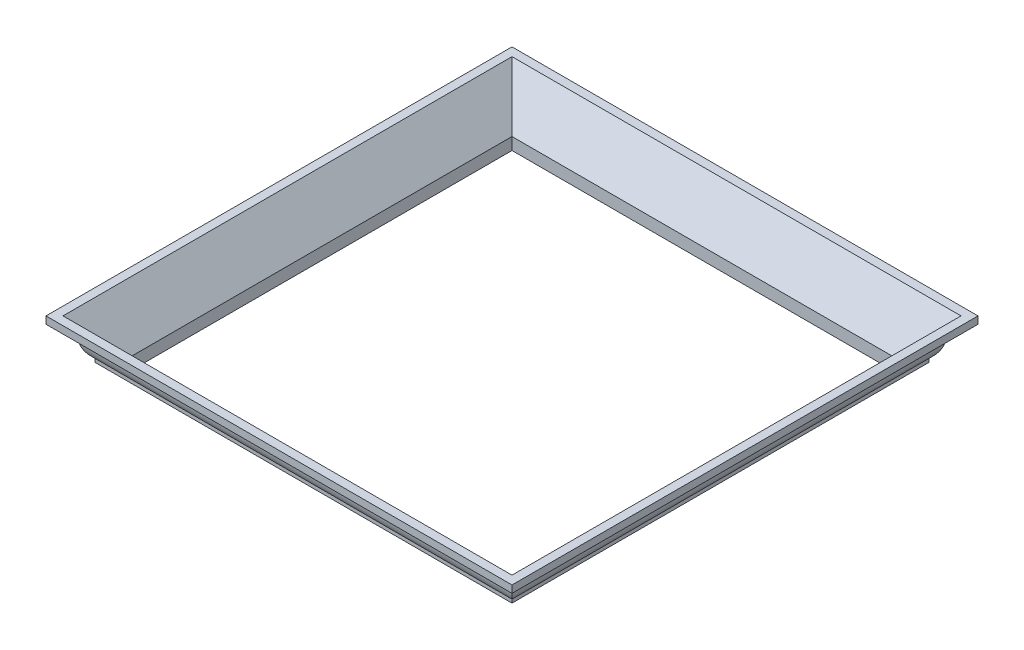
ISO-10303-21;
HEADER;
FILE_DESCRIPTION(('STEP AP214'),'2;1');
FILE_NAME('part.step','',(''),(''),'','','');
FILE_SCHEMA(('AUTOMOTIVE_DESIGN { 1 0 10303 214 1 1 1 1 }'));
ENDSEC;
DATA;
#1=APPLICATION_CONTEXT('core data for automotive mechanical design processes');
#2=APPLICATION_PROTOCOL_DEFINITION('international standard','automotive_design',2000,#1);
#3=PRODUCT_CONTEXT('',#1,'mechanical');
#4=PRODUCT('Part','Part','',(#3));
#5=PRODUCT_RELATED_PRODUCT_CATEGORY('part','',(#4));
#6=PRODUCT_DEFINITION_FORMATION('','',#4);
#7=PRODUCT_DEFINITION_CONTEXT('part definition',#1,'design');
#8=PRODUCT_DEFINITION('design','',#6,#7);
#9=PRODUCT_DEFINITION_SHAPE('','',#8);
#10=(LENGTH_UNIT() NAMED_UNIT(*) SI_UNIT(.MILLI.,.METRE.));
#11=(NAMED_UNIT(*) PLANE_ANGLE_UNIT() SI_UNIT($,.RADIAN.));
#12=(NAMED_UNIT(*) SI_UNIT($,.STERADIAN.) SOLID_ANGLE_UNIT());
#13=UNCERTAINTY_MEASURE_WITH_UNIT(LENGTH_MEASURE(1.E-05),#10,'distance_accuracy_value','');
#14=(GEOMETRIC_REPRESENTATION_CONTEXT(3) GLOBAL_UNCERTAINTY_ASSIGNED_CONTEXT((#13)) GLOBAL_UNIT_ASSIGNED_CONTEXT((#10,
#11,#12)) REPRESENTATION_CONTEXT('',''));
#15=CARTESIAN_POINT('',(0.,0.,0.));
#16=DIRECTION('',(0.,0.,1.));
#17=DIRECTION('',(1.,0.,0.));
#18=AXIS2_PLACEMENT_3D('',#15,#16,#17);
#19=CARTESIAN_POINT('',(0.,0.,1219.2));
#20=DIRECTION('',(0.,1.,0.));
#21=DIRECTION('',(0.,0.,1.));
#22=AXIS2_PLACEMENT_3D('',#19,#20,#21);
#23=PLANE('',#22);
#24=DIRECTION('',(1.,0.,0.));
#25=VECTOR('',#24,1.);
#26=CARTESIAN_POINT('',(-1117.6,0.,92.0750000000012));
#27=LINE('',#26,#25);
#28=CARTESIAN_POINT('',(-1025.525,0.,92.0750000000011));
#29=VERTEX_POINT('',#28);
#30=CARTESIAN_POINT('',(9.52499999999935,0.,92.0750000000002));
#31=VERTEX_POINT('',#30);
#32=EDGE_CURVE('E292',#29,#31,#27,.T.);
#33=ORIENTED_EDGE('',*,*,#32,.T.);
#34=DIRECTION('',(0.,0.,-1.));
#35=VECTOR('',#34,1.);
#36=CARTESIAN_POINT('',(9.525,0.,1219.2));
#37=LINE('',#36,#35);
#38=CARTESIAN_POINT('',(9.52500000000001,0.,1127.125));
#39=VERTEX_POINT('',#38);
#40=EDGE_CURVE('E13',#39,#31,#37,.T.);
#41=ORIENTED_EDGE('',*,*,#40,.F.);
#42=DIRECTION('',(-1.,0.,0.));
#43=VECTOR('',#42,1.);
#44=CARTESIAN_POINT('',(101.6,0.,1127.125));
#45=LINE('',#44,#43);
#46=CARTESIAN_POINT('',(-1025.525,0.,1127.125));
#47=VERTEX_POINT('',#46);
#48=EDGE_CURVE('E63',#39,#47,#45,.T.);
#49=ORIENTED_EDGE('',*,*,#48,.T.);
#50=DIRECTION('',(0.,0.,1.));
#51=VECTOR('',#50,1.);
#52=CARTESIAN_POINT('',(-1025.525,0.,1.20736753927986E-12));
#53=LINE('',#52,#51);
#54=EDGE_CURVE('E369',#29,#47,#53,.T.);
#55=ORIENTED_EDGE('',*,*,#54,.F.);
#56=EDGE_LOOP('',(#33,#41,#49,#55));
#57=FACE_BOUND('',#56,.T.);
#58=DIRECTION('',(0.,0.,-1.));
#59=VECTOR('',#58,1.);
#60=CARTESIAN_POINT('',(0.,0.,1219.2));
#61=LINE('',#60,#59);
#62=CARTESIAN_POINT('',(0.,0.,1117.6));
#63=VERTEX_POINT('',#62);
#64=CARTESIAN_POINT('',(0.,0.,101.6));
#65=VERTEX_POINT('',#64);
#66=EDGE_CURVE('E229',#63,#65,#61,.T.);
#67=ORIENTED_EDGE('',*,*,#66,.T.);
#68=DIRECTION('',(1.,0.,0.));
#69=VECTOR('',#68,1.);
#70=CARTESIAN_POINT('',(-1117.6,0.,101.600000000001));
#71=LINE('',#70,#69);
#72=CARTESIAN_POINT('',(-1016.,0.,101.600000000001));
#73=VERTEX_POINT('',#72);
#74=EDGE_CURVE('E195',#73,#65,#71,.T.);
#75=ORIENTED_EDGE('',*,*,#74,.F.);
#76=DIRECTION('',(0.,0.,1.));
#77=VECTOR('',#76,1.);
#78=CARTESIAN_POINT('',(-1016.,0.,1.19348975147204E-12));
#79=LINE('',#78,#77);
#80=CARTESIAN_POINT('',(-1016.,0.,1117.6));
#81=VERTEX_POINT('',#80);
#82=EDGE_CURVE('E181',#73,#81,#79,.T.);
#83=ORIENTED_EDGE('',*,*,#82,.T.);
#84=DIRECTION('',(-1.,0.,0.));
#85=VECTOR('',#84,1.);
#86=CARTESIAN_POINT('',(101.6,0.,1117.6));
#87=LINE('',#86,#85);
#88=EDGE_CURVE('E193',#63,#81,#87,.T.);
#89=ORIENTED_EDGE('',*,*,#88,.F.);
#90=EDGE_LOOP('',(#67,#75,#83,#89));
#91=FACE_BOUND('',#90,.T.);
#92=ADVANCED_FACE('F49',(#57,#91),#23,.F.);
#93=CARTESIAN_POINT('',(37.6152671755725,0.,1219.2));
#94=DIRECTION('',(0.,0.,-1.));
#95=DIRECTION('',(-1.,0.,0.));
#96=AXIS2_PLACEMENT_3D('',#93,#94,#95);
#97=CYLINDRICAL_SURFACE('',#96,28.0902671755725);
#98=ORIENTED_EDGE('',*,*,#40,.T.);
#99=CARTESIAN_POINT('',(37.6152671755725,0.,63.9847328244274));
#100=DIRECTION('',(0.707106781186548,0.,0.707106781186547));
#101=DIRECTION('',(0.707106781186547,0.,-0.707106781186548));
#102=AXIS2_PLACEMENT_3D('',#99,#100,#101);
#103=ELLIPSE('',#102,39.7256368103785,28.0902671755725);
#104=CARTESIAN_POINT('',(37.6152671755725,28.0902671755725,63.9847328244274));
#105=VERTEX_POINT('',#104);
#106=EDGE_CURVE('E262',#31,#105,#103,.F.);
#107=ORIENTED_EDGE('',*,*,#106,.T.);
#108=DIRECTION('',(0.,0.,-1.));
#109=VECTOR('',#108,1.);
#110=CARTESIAN_POINT('',(37.6152671755725,28.0902671755725,1219.2));
#111=LINE('',#110,#109);
#112=CARTESIAN_POINT('',(37.6152671755725,28.0902671755725,1155.21526717557));
#113=VERTEX_POINT('',#112);
#114=EDGE_CURVE('E56',#113,#105,#111,.T.);
#115=ORIENTED_EDGE('',*,*,#114,.F.);
#116=CARTESIAN_POINT('',(37.6152671755725,0.,1155.21526717557));
#117=DIRECTION('',(0.707106781186547,0.,-0.707106781186548));
#118=DIRECTION('',(-0.707106781186548,0.,-0.707106781186547));
#119=AXIS2_PLACEMENT_3D('',#116,#117,#118);
#120=ELLIPSE('',#119,39.7256368103784,28.0902671755725);
#121=EDGE_CURVE('E207',#113,#39,#120,.F.);
#122=ORIENTED_EDGE('',*,*,#121,.T.);
#123=EDGE_LOOP('',(#98,#107,#115,#122));
#124=FACE_BOUND('',#123,.T.);
#125=ADVANCED_FACE('F260',(#124),#97,.F.);
#126=CARTESIAN_POINT('',(37.6152671755725,28.0902671755725,1219.2));
#127=DIRECTION('',(-1.,0.,0.));
#128=DIRECTION('',(0.,0.,1.));
#129=AXIS2_PLACEMENT_3D('',#126,#127,#128);
#130=PLANE('',#129);
#131=ORIENTED_EDGE('',*,*,#114,.T.);
#132=DIRECTION('',(0.,1.,0.));
#133=VECTOR('',#132,1.);
#134=CARTESIAN_POINT('',(37.6152671755725,28.0902671755725,63.9847328244274));
#135=LINE('',#134,#133);
#136=CARTESIAN_POINT('',(37.6152671755725,37.6152671755725,63.9847328244274));
#137=VERTEX_POINT('',#136);
#138=EDGE_CURVE('E255',#105,#137,#135,.T.);
#139=ORIENTED_EDGE('',*,*,#138,.T.);
#140=DIRECTION('',(0.,0.,-1.));
#141=VECTOR('',#140,1.);
#142=CARTESIAN_POINT('',(37.6152671755725,37.6152671755725,1219.2));
#143=LINE('',#142,#141);
#144=CARTESIAN_POINT('',(37.6152671755725,37.6152671755725,1155.21526717557));
#145=VERTEX_POINT('',#144);
#146=EDGE_CURVE('E246',#145,#137,#143,.T.);
#147=ORIENTED_EDGE('',*,*,#146,.F.);
#148=DIRECTION('',(0.,-1.,0.));
#149=VECTOR('',#148,1.);
#150=CARTESIAN_POINT('',(37.6152671755725,28.0902671755725,1155.21526717557));
#151=LINE('',#150,#149);
#152=EDGE_CURVE('E257',#145,#113,#151,.T.);
#153=ORIENTED_EDGE('',*,*,#152,.T.);
#154=EDGE_LOOP('',(#131,#139,#147,#153));
#155=FACE_BOUND('',#154,.T.);
#156=ADVANCED_FACE('F253',(#155),#130,.F.);
#157=CARTESIAN_POINT('',(1.63914448588406,82.3520465529375,1219.2));
#158=DIRECTION('',(0.,0.,-1.));
#159=DIRECTION('',(-1.,0.,0.));
#160=AXIS2_PLACEMENT_3D('',#157,#158,#159);
#161=CYLINDRICAL_SURFACE('',#160,57.4078464396858);
#162=ORIENTED_EDGE('',*,*,#146,.T.);
#163=CARTESIAN_POINT('',(1.63914448588418,82.3520465529375,99.9608555141159));
#164=DIRECTION('',(0.707106781186548,0.,0.707106781186547));
#165=DIRECTION('',(0.707106781186547,0.,-0.707106781186548));
#166=AXIS2_PLACEMENT_3D('',#163,#164,#165);
#167=ELLIPSE('',#166,81.1869550216357,57.4078464396858);
#168=CARTESIAN_POINT('',(58.9991836504102,80.0096674447318,42.6008163495896));
#169=VERTEX_POINT('',#168);
#170=EDGE_CURVE('E269',#137,#169,#167,.T.);
#171=ORIENTED_EDGE('',*,*,#170,.T.);
#172=DIRECTION('',(0.,0.,-1.));
#173=VECTOR('',#172,1.);
#174=CARTESIAN_POINT('',(58.9991836504103,80.0096674447318,1219.2));
#175=LINE('',#174,#173);
#176=CARTESIAN_POINT('',(58.9991836504105,80.0096674447318,1176.59918365041));
#177=VERTEX_POINT('',#176);
#178=EDGE_CURVE('E243',#177,#169,#175,.T.);
#179=ORIENTED_EDGE('',*,*,#178,.F.);
#180=CARTESIAN_POINT('',(1.63914448588409,82.3520465529375,1119.23914448588));
#181=DIRECTION('',(0.707106781186547,0.,-0.707106781186548));
#182=DIRECTION('',(-0.707106781186548,0.,-0.707106781186547));
#183=AXIS2_PLACEMENT_3D('',#180,#181,#182);
#184=ELLIPSE('',#183,81.1869550216356,57.4078464396858);
#185=EDGE_CURVE('E301',#177,#145,#184,.T.);
#186=ORIENTED_EDGE('',*,*,#185,.T.);
#187=EDGE_LOOP('',(#162,#171,#179,#186));
#188=FACE_BOUND('',#187,.T.);
#189=ADVANCED_FACE('F307',(#188),#161,.T.);
#190=CARTESIAN_POINT('',(102.277852077846,69.85,1219.2));
#191=DIRECTION('',(0.,0.,-1.));
#192=DIRECTION('',(-1.,0.,0.));
#193=AXIS2_PLACEMENT_3D('',#190,#191,#192);
#194=CYLINDRICAL_SURFACE('',#193,44.4551682421677);
#195=ORIENTED_EDGE('',*,*,#178,.T.);
#196=CARTESIAN_POINT('',(102.277852077846,69.85,-0.677852077845889));
#197=DIRECTION('',(0.707106781186548,0.,0.707106781186547));
#198=DIRECTION('',(0.707106781186547,0.,-0.707106781186548));
#199=AXIS2_PLACEMENT_3D('',#196,#197,#198);
#200=ELLIPSE('',#199,62.8691018456514,44.4551682421677);
#201=CARTESIAN_POINT('',(101.6,114.3,-1.11022302462516E-13));
#202=VERTEX_POINT('',#201);
#203=EDGE_CURVE('E376',#169,#202,#200,.F.);
#204=ORIENTED_EDGE('',*,*,#203,.T.);
#205=DIRECTION('',(0.,0.,-1.));
#206=VECTOR('',#205,1.);
#207=CARTESIAN_POINT('',(101.6,114.3,1219.2));
#208=LINE('',#207,#206);
#209=CARTESIAN_POINT('',(101.6,114.3,1219.2));
#210=VERTEX_POINT('',#209);
#211=EDGE_CURVE('E240',#210,#202,#208,.T.);
#212=ORIENTED_EDGE('',*,*,#211,.F.);
#213=CARTESIAN_POINT('',(102.277852077846,69.85,1219.87785207785));
#214=DIRECTION('',(0.707106781186547,0.,-0.707106781186548));
#215=DIRECTION('',(-0.707106781186548,0.,-0.707106781186547));
#216=AXIS2_PLACEMENT_3D('',#213,#214,#215);
#217=ELLIPSE('',#216,62.8691018456513,44.4551682421677);
#218=EDGE_CURVE('E298',#210,#177,#217,.F.);
#219=ORIENTED_EDGE('',*,*,#218,.T.);
#220=EDGE_LOOP('',(#195,#204,#212,#219));
#221=FACE_BOUND('',#220,.T.);
#222=ADVANCED_FACE('F315',(#221),#194,.F.);
#223=CARTESIAN_POINT('',(101.6,133.35,1219.2));
#224=DIRECTION('',(-1.,0.,0.));
#225=DIRECTION('',(0.,-1.,0.));
#226=AXIS2_PLACEMENT_3D('',#223,#224,#225);
#227=PLANE('',#226);
#228=DIRECTION('',(0.,1.,0.));
#229=VECTOR('',#228,1.);
#230=CARTESIAN_POINT('',(101.6,133.35,-1.11022302462516E-13));
#231=LINE('',#230,#229);
#232=CARTESIAN_POINT('',(101.6,133.35,-1.11022302462516E-13));
#233=VERTEX_POINT('',#232);
#234=EDGE_CURVE('E265',#202,#233,#231,.T.);
#235=ORIENTED_EDGE('',*,*,#234,.T.);
#236=DIRECTION('',(0.,0.,-1.));
#237=VECTOR('',#236,1.);
#238=CARTESIAN_POINT('',(101.6,133.35,1219.2));
#239=LINE('',#238,#237);
#240=CARTESIAN_POINT('',(101.6,133.35,1219.2));
#241=VERTEX_POINT('',#240);
#242=EDGE_CURVE('E237',#241,#233,#239,.T.);
#243=ORIENTED_EDGE('',*,*,#242,.F.);
#244=DIRECTION('',(0.,1.,0.));
#245=VECTOR('',#244,1.);
#246=CARTESIAN_POINT('',(101.6,133.35,1219.2));
#247=LINE('',#246,#245);
#248=EDGE_CURVE('E202',#210,#241,#247,.T.);
#249=ORIENTED_EDGE('',*,*,#248,.F.);
#250=ORIENTED_EDGE('',*,*,#211,.T.);
#251=EDGE_LOOP('',(#235,#243,#249,#250));
#252=FACE_BOUND('',#251,.T.);
#253=ADVANCED_FACE('F397',(#252),#227,.F.);
#254=CARTESIAN_POINT('',(79.3786196530827,133.35,1219.2));
#255=DIRECTION('',(0.,-1.,0.));
#256=DIRECTION('',(0.,0.,-1.));
#257=AXIS2_PLACEMENT_3D('',#254,#255,#256);
#258=PLANE('',#257);
#259=ORIENTED_EDGE('',*,*,#242,.T.);
#260=DIRECTION('',(1.,0.,0.));
#261=VECTOR('',#260,1.);
#262=CARTESIAN_POINT('',(-1117.6,133.35,1.2490009027033E-12));
#263=LINE('',#262,#261);
#264=CARTESIAN_POINT('',(-1117.6,133.35,1.31838984174237E-12));
#265=VERTEX_POINT('',#264);
#266=EDGE_CURVE('E280',#265,#233,#263,.T.);
#267=ORIENTED_EDGE('',*,*,#266,.F.);
#268=DIRECTION('',(0.,0.,1.));
#269=VECTOR('',#268,1.);
#270=CARTESIAN_POINT('',(-1117.6,133.35,1.31838984174237E-12));
#271=LINE('',#270,#269);
#272=CARTESIAN_POINT('',(-1117.6,133.35,1219.2));
#273=VERTEX_POINT('',#272);
#274=EDGE_CURVE('E358',#265,#273,#271,.T.);
#275=ORIENTED_EDGE('',*,*,#274,.T.);
#276=DIRECTION('',(-1.,0.,0.));
#277=VECTOR('',#276,1.);
#278=CARTESIAN_POINT('',(101.6,133.35,1219.2));
#279=LINE('',#278,#277);
#280=EDGE_CURVE('E213',#241,#273,#279,.T.);
#281=ORIENTED_EDGE('',*,*,#280,.F.);
#282=EDGE_LOOP('',(#259,#267,#275,#281));
#283=FACE_BOUND('',#282,.T.);
#284=DIRECTION('',(1.,0.,0.));
#285=VECTOR('',#284,1.);
#286=CARTESIAN_POINT('',(-1117.6,133.35,22.2213803469186));
#287=LINE('',#286,#285);
#288=CARTESIAN_POINT('',(-1095.37861965308,133.35,22.2213803469186));
#289=VERTEX_POINT('',#288);
#290=CARTESIAN_POINT('',(79.3786196530819,133.35,22.2213803469175));
#291=VERTEX_POINT('',#290);
#292=EDGE_CURVE('E277',#289,#291,#287,.T.);
#293=ORIENTED_EDGE('',*,*,#292,.T.);
#294=DIRECTION('',(0.,0.,-1.));
#295=VECTOR('',#294,1.);
#296=CARTESIAN_POINT('',(79.3786196530827,133.35,1219.2));
#297=LINE('',#296,#295);
#298=CARTESIAN_POINT('',(79.3786196530826,133.35,1196.97861965308));
#299=VERTEX_POINT('',#298);
#300=EDGE_CURVE('E234',#299,#291,#297,.T.);
#301=ORIENTED_EDGE('',*,*,#300,.F.);
#302=DIRECTION('',(-1.,0.,0.));
#303=VECTOR('',#302,1.);
#304=CARTESIAN_POINT('',(101.6,133.35,1196.97861965308));
#305=LINE('',#304,#303);
#306=CARTESIAN_POINT('',(-1095.37861965308,133.35,1196.97861965308));
#307=VERTEX_POINT('',#306);
#308=EDGE_CURVE('E204',#299,#307,#305,.T.);
#309=ORIENTED_EDGE('',*,*,#308,.T.);
#310=DIRECTION('',(0.,0.,1.));
#311=VECTOR('',#310,1.);
#312=CARTESIAN_POINT('',(-1095.37861965308,133.35,1.29063426612674E-12));
#313=LINE('',#312,#311);
#314=EDGE_CURVE('E356',#289,#307,#313,.T.);
#315=ORIENTED_EDGE('',*,*,#314,.F.);
#316=EDGE_LOOP('',(#293,#301,#309,#315));
#317=FACE_BOUND('',#316,.T.);
#318=ADVANCED_FACE('F405',(#283,#317),#258,.F.);
#319=CARTESIAN_POINT('',(0.,31.75,1219.2));
#320=DIRECTION('',(0.788010753606721,-0.615661475325659,0.));
#321=DIRECTION('',(0.615661475325659,0.788010753606721,0.));
#322=AXIS2_PLACEMENT_3D('',#319,#320,#321);
#323=PLANE('',#322);
#324=ORIENTED_EDGE('',*,*,#300,.T.);
#325=DIRECTION('',(-0.524268417664046,-0.671032974212201,0.524268417664048));
#326=VECTOR('',#325,1.);
#327=CARTESIAN_POINT('',(-307.180600914135,-361.423239712088,408.780600914136));
#328=LINE('',#327,#326);
#329=CARTESIAN_POINT('',(0.,31.75,101.6));
#330=VERTEX_POINT('',#329);
#331=EDGE_CURVE('E373',#291,#330,#328,.T.);
#332=ORIENTED_EDGE('',*,*,#331,.T.);
#333=DIRECTION('',(0.,0.,-1.));
#334=VECTOR('',#333,1.);
#335=CARTESIAN_POINT('',(0.,31.75,1219.2));
#336=LINE('',#335,#334);
#337=CARTESIAN_POINT('',(0.,31.75,1117.6));
#338=VERTEX_POINT('',#337);
#339=EDGE_CURVE('E231',#338,#330,#336,.T.);
#340=ORIENTED_EDGE('',*,*,#339,.F.);
#341=DIRECTION('',(0.524268417664047,0.671032974212201,0.524268417664047));
#342=VECTOR('',#341,1.);
#343=CARTESIAN_POINT('',(27.9255091740123,67.493021792008,1145.52550917401));
#344=LINE('',#343,#342);
#345=EDGE_CURVE('E295',#338,#299,#344,.T.);
#346=ORIENTED_EDGE('',*,*,#345,.T.);
#347=EDGE_LOOP('',(#324,#332,#340,#346));
#348=FACE_BOUND('',#347,.T.);
#349=ADVANCED_FACE('F440',(#348),#323,.F.);
#350=CARTESIAN_POINT('',(0.,0.,1219.2));
#351=DIRECTION('',(1.,0.,0.));
#352=DIRECTION('',(0.,1.,0.));
#353=AXIS2_PLACEMENT_3D('',#350,#351,#352);
#354=PLANE('',#353);
#355=ORIENTED_EDGE('',*,*,#339,.T.);
#356=DIRECTION('',(0.,1.,0.));
#357=VECTOR('',#356,1.);
#358=CARTESIAN_POINT('',(0.,0.,101.6));
#359=LINE('',#358,#357);
#360=EDGE_CURVE('E371',#65,#330,#359,.T.);
#361=ORIENTED_EDGE('',*,*,#360,.F.);
#362=ORIENTED_EDGE('',*,*,#66,.F.);
#363=DIRECTION('',(0.,1.,0.));
#364=VECTOR('',#363,1.);
#365=CARTESIAN_POINT('',(0.,0.,1117.6));
#366=LINE('',#365,#364);
#367=EDGE_CURVE('E200',#63,#338,#366,.T.);
#368=ORIENTED_EDGE('',*,*,#367,.T.);
#369=EDGE_LOOP('',(#355,#361,#362,#368));
#370=FACE_BOUND('',#369,.T.);
#371=ADVANCED_FACE('F433',(#370),#354,.F.);
#372=CARTESIAN_POINT('',(101.6,0.,1155.21526717557));
#373=DIRECTION('',(-1.,0.,0.));
#374=DIRECTION('',(0.,0.,-1.));
#375=AXIS2_PLACEMENT_3D('',#372,#373,#374);
#376=CYLINDRICAL_SURFACE('',#375,28.0902671755725);
#377=ORIENTED_EDGE('',*,*,#48,.F.);
#378=ORIENTED_EDGE('',*,*,#121,.F.);
#379=DIRECTION('',(-1.,0.,0.));
#380=VECTOR('',#379,1.);
#381=CARTESIAN_POINT('',(101.6,28.0902671755725,1155.21526717557));
#382=LINE('',#381,#380);
#383=CARTESIAN_POINT('',(-1053.61526717557,28.0902671755725,1155.21526717557));
#384=VERTEX_POINT('',#383);
#385=EDGE_CURVE('E225',#113,#384,#382,.T.);
#386=ORIENTED_EDGE('',*,*,#385,.T.);
#387=CARTESIAN_POINT('',(-1053.61526717557,0.,1155.21526717557));
#388=DIRECTION('',(-0.707106781186548,0.,-0.707106781186547));
#389=DIRECTION('',(-0.707106781186547,0.,0.707106781186548));
#390=AXIS2_PLACEMENT_3D('',#387,#388,#389);
#391=ELLIPSE('',#390,39.7256368103785,28.0902671755725);
#392=EDGE_CURVE('E335',#47,#384,#391,.F.);
#393=ORIENTED_EDGE('',*,*,#392,.F.);
#394=EDGE_LOOP('',(#377,#378,#386,#393));
#395=FACE_BOUND('',#394,.T.);
#396=ADVANCED_FACE('F431',(#395),#376,.F.);
#397=CARTESIAN_POINT('',(101.6,28.0902671755725,1155.21526717557));
#398=DIRECTION('',(0.,0.,-1.));
#399=DIRECTION('',(1.,0.,0.));
#400=AXIS2_PLACEMENT_3D('',#397,#398,#399);
#401=PLANE('',#400);
#402=ORIENTED_EDGE('',*,*,#385,.F.);
#403=ORIENTED_EDGE('',*,*,#152,.F.);
#404=DIRECTION('',(-1.,0.,0.));
#405=VECTOR('',#404,1.);
#406=CARTESIAN_POINT('',(101.6,37.6152671755725,1155.21526717557));
#407=LINE('',#406,#405);
#408=CARTESIAN_POINT('',(-1053.61526717557,37.6152671755725,1155.21526717557));
#409=VERTEX_POINT('',#408);
#410=EDGE_CURVE('E222',#145,#409,#407,.T.);
#411=ORIENTED_EDGE('',*,*,#410,.T.);
#412=DIRECTION('',(0.,1.,0.));
#413=VECTOR('',#412,1.);
#414=CARTESIAN_POINT('',(-1053.61526717557,28.0902671755725,1155.21526717557));
#415=LINE('',#414,#413);
#416=EDGE_CURVE('E328',#384,#409,#415,.T.);
#417=ORIENTED_EDGE('',*,*,#416,.F.);
#418=EDGE_LOOP('',(#402,#403,#411,#417));
#419=FACE_BOUND('',#418,.T.);
#420=ADVANCED_FACE('F430',(#419),#401,.F.);
#421=CARTESIAN_POINT('',(101.6,82.3520465529375,1119.23914448588));
#422=DIRECTION('',(-1.,0.,0.));
#423=DIRECTION('',(0.,0.,-1.));
#424=AXIS2_PLACEMENT_3D('',#421,#422,#423);
#425=CYLINDRICAL_SURFACE('',#424,57.4078464396858);
#426=ORIENTED_EDGE('',*,*,#410,.F.);
#427=ORIENTED_EDGE('',*,*,#185,.F.);
#428=DIRECTION('',(-1.,0.,0.));
#429=VECTOR('',#428,1.);
#430=CARTESIAN_POINT('',(101.6,80.0096674447318,1176.59918365041));
#431=LINE('',#430,#429);
#432=CARTESIAN_POINT('',(-1074.99918365041,80.0096674447318,1176.59918365041));
#433=VERTEX_POINT('',#432);
#434=EDGE_CURVE('E219',#177,#433,#431,.T.);
#435=ORIENTED_EDGE('',*,*,#434,.T.);
#436=CARTESIAN_POINT('',(-1017.63914448588,82.3520465529375,1119.23914448589));
#437=DIRECTION('',(-0.707106781186548,0.,-0.707106781186547));
#438=DIRECTION('',(-0.707106781186547,0.,0.707106781186548));
#439=AXIS2_PLACEMENT_3D('',#436,#437,#438);
#440=ELLIPSE('',#439,81.1869550216357,57.4078464396858);
#441=EDGE_CURVE('E325',#409,#433,#440,.T.);
#442=ORIENTED_EDGE('',*,*,#441,.F.);
#443=EDGE_LOOP('',(#426,#427,#435,#442));
#444=FACE_BOUND('',#443,.T.);
#445=ADVANCED_FACE('F310',(#444),#425,.T.);
#446=CARTESIAN_POINT('',(101.6,69.85,1219.87785207785));
#447=DIRECTION('',(-1.,0.,0.));
#448=DIRECTION('',(0.,0.,-1.));
#449=AXIS2_PLACEMENT_3D('',#446,#447,#448);
#450=CYLINDRICAL_SURFACE('',#449,44.4551682421677);
#451=ORIENTED_EDGE('',*,*,#434,.F.);
#452=ORIENTED_EDGE('',*,*,#218,.F.);
#453=DIRECTION('',(-1.,0.,0.));
#454=VECTOR('',#453,1.);
#455=CARTESIAN_POINT('',(101.6,114.3,1219.2));
#456=LINE('',#455,#454);
#457=CARTESIAN_POINT('',(-1117.6,114.3,1219.2));
#458=VERTEX_POINT('',#457);
#459=EDGE_CURVE('E216',#210,#458,#456,.T.);
#460=ORIENTED_EDGE('',*,*,#459,.T.);
#461=CARTESIAN_POINT('',(-1118.27785207785,69.85,1219.87785207785));
#462=DIRECTION('',(-0.707106781186548,0.,-0.707106781186547));
#463=DIRECTION('',(-0.707106781186547,0.,0.707106781186548));
#464=AXIS2_PLACEMENT_3D('',#461,#462,#463);
#465=ELLIPSE('',#464,62.8691018456514,44.4551682421677);
#466=EDGE_CURVE('E322',#433,#458,#465,.F.);
#467=ORIENTED_EDGE('',*,*,#466,.F.);
#468=EDGE_LOOP('',(#451,#452,#460,#467));
#469=FACE_BOUND('',#468,.T.);
#470=ADVANCED_FACE('F319',(#469),#450,.F.);
#471=CARTESIAN_POINT('',(101.6,133.35,1219.2));
#472=DIRECTION('',(0.,0.,-1.));
#473=DIRECTION('',(0.,-1.,0.));
#474=AXIS2_PLACEMENT_3D('',#471,#472,#473);
#475=PLANE('',#474);
#476=DIRECTION('',(0.,1.,0.));
#477=VECTOR('',#476,1.);
#478=CARTESIAN_POINT('',(-1117.6,133.35,1219.2));
#479=LINE('',#478,#477);
#480=EDGE_CURVE('E351',#458,#273,#479,.T.);
#481=ORIENTED_EDGE('',*,*,#480,.F.);
#482=ORIENTED_EDGE('',*,*,#459,.F.);
#483=ORIENTED_EDGE('',*,*,#248,.T.);
#484=ORIENTED_EDGE('',*,*,#280,.T.);
#485=EDGE_LOOP('',(#481,#482,#483,#484));
#486=FACE_BOUND('',#485,.T.);
#487=ADVANCED_FACE('F400',(#486),#475,.F.);
#488=CARTESIAN_POINT('',(101.6,31.75,1117.6));
#489=DIRECTION('',(0.,-0.615661475325659,0.788010753606721));
#490=DIRECTION('',(0.,0.788010753606721,0.615661475325659));
#491=AXIS2_PLACEMENT_3D('',#488,#489,#490);
#492=PLANE('',#491);
#493=ORIENTED_EDGE('',*,*,#308,.F.);
#494=ORIENTED_EDGE('',*,*,#345,.F.);
#495=DIRECTION('',(-1.,0.,0.));
#496=VECTOR('',#495,1.);
#497=CARTESIAN_POINT('',(101.6,31.75,1117.6));
#498=LINE('',#497,#496);
#499=CARTESIAN_POINT('',(-1016.,31.75,1117.6));
#500=VERTEX_POINT('',#499);
#501=EDGE_CURVE('E201',#338,#500,#498,.T.);
#502=ORIENTED_EDGE('',*,*,#501,.T.);
#503=DIRECTION('',(0.524268417664047,-0.671032974212201,-0.524268417664047));
#504=VECTOR('',#503,1.);
#505=CARTESIAN_POINT('',(-708.819399085864,-361.423239712088,810.419399085866));
#506=LINE('',#505,#504);
#507=EDGE_CURVE('E187',#307,#500,#506,.T.);
#508=ORIENTED_EDGE('',*,*,#507,.F.);
#509=EDGE_LOOP('',(#493,#494,#502,#508));
#510=FACE_BOUND('',#509,.T.);
#511=ADVANCED_FACE('F520',(#510),#492,.F.);
#512=CARTESIAN_POINT('',(101.6,0.,1117.6));
#513=DIRECTION('',(0.,0.,1.));
#514=DIRECTION('',(0.,1.,0.));
#515=AXIS2_PLACEMENT_3D('',#512,#513,#514);
#516=PLANE('',#515);
#517=ORIENTED_EDGE('',*,*,#501,.F.);
#518=ORIENTED_EDGE('',*,*,#367,.F.);
#519=ORIENTED_EDGE('',*,*,#88,.T.);
#520=DIRECTION('',(0.,1.,0.));
#521=VECTOR('',#520,1.);
#522=CARTESIAN_POINT('',(-1016.,0.,1117.6));
#523=LINE('',#522,#521);
#524=EDGE_CURVE('E177',#81,#500,#523,.T.);
#525=ORIENTED_EDGE('',*,*,#524,.T.);
#526=EDGE_LOOP('',(#517,#518,#519,#525));
#527=FACE_BOUND('',#526,.T.);
#528=ADVANCED_FACE('F198',(#527),#516,.F.);
#529=CARTESIAN_POINT('',(-1117.6,0.,63.9847328244287));
#530=DIRECTION('',(1.,0.,0.));
#531=DIRECTION('',(0.,0.,1.));
#532=AXIS2_PLACEMENT_3D('',#529,#530,#531);
#533=CYLINDRICAL_SURFACE('',#532,28.0902671755725);
#534=ORIENTED_EDGE('',*,*,#32,.F.);
#535=CARTESIAN_POINT('',(-1053.61526717557,0.,63.9847328244287));
#536=DIRECTION('',(-0.707106781186547,0.,0.707106781186548));
#537=DIRECTION('',(0.707106781186548,0.,0.707106781186547));
#538=AXIS2_PLACEMENT_3D('',#535,#536,#537);
#539=ELLIPSE('',#538,39.7256368103784,28.0902671755725);
#540=CARTESIAN_POINT('',(-1053.61526717557,28.0902671755725,63.9847328244287));
#541=VERTEX_POINT('',#540);
#542=EDGE_CURVE('E349',#541,#29,#539,.F.);
#543=ORIENTED_EDGE('',*,*,#542,.F.);
#544=DIRECTION('',(1.,0.,0.));
#545=VECTOR('',#544,1.);
#546=CARTESIAN_POINT('',(-1117.6,28.0902671755725,63.9847328244287));
#547=LINE('',#546,#545);
#548=EDGE_CURVE('E71',#541,#105,#547,.T.);
#549=ORIENTED_EDGE('',*,*,#548,.T.);
#550=ORIENTED_EDGE('',*,*,#106,.F.);
#551=EDGE_LOOP('',(#534,#543,#549,#550));
#552=FACE_BOUND('',#551,.T.);
#553=ADVANCED_FACE('F426',(#552),#533,.F.);
#554=CARTESIAN_POINT('',(-1117.6,28.0902671755725,63.9847328244287));
#555=DIRECTION('',(0.,0.,1.));
#556=DIRECTION('',(-1.,0.,0.));
#557=AXIS2_PLACEMENT_3D('',#554,#555,#556);
#558=PLANE('',#557);
#559=ORIENTED_EDGE('',*,*,#548,.F.);
#560=DIRECTION('',(0.,-1.,0.));
#561=VECTOR('',#560,1.);
#562=CARTESIAN_POINT('',(-1053.61526717557,28.0902671755725,63.9847328244287));
#563=LINE('',#562,#561);
#564=CARTESIAN_POINT('',(-1053.61526717557,37.6152671755725,63.9847328244287));
#565=VERTEX_POINT('',#564);
#566=EDGE_CURVE('E346',#565,#541,#563,.T.);
#567=ORIENTED_EDGE('',*,*,#566,.F.);
#568=DIRECTION('',(1.,0.,0.));
#569=VECTOR('',#568,1.);
#570=CARTESIAN_POINT('',(-1117.6,37.6152671755725,63.9847328244287));
#571=LINE('',#570,#569);
#572=EDGE_CURVE('E288',#565,#137,#571,.T.);
#573=ORIENTED_EDGE('',*,*,#572,.T.);
#574=ORIENTED_EDGE('',*,*,#138,.F.);
#575=EDGE_LOOP('',(#559,#567,#573,#574));
#576=FACE_BOUND('',#575,.T.);
#577=ADVANCED_FACE('F384',(#576),#558,.F.);
#578=CARTESIAN_POINT('',(-1117.6,82.3520465529375,99.9608555141172));
#579=DIRECTION('',(1.,0.,0.));
#580=DIRECTION('',(0.,0.,1.));
#581=AXIS2_PLACEMENT_3D('',#578,#579,#580);
#582=CYLINDRICAL_SURFACE('',#581,57.4078464396858);
#583=ORIENTED_EDGE('',*,*,#572,.F.);
#584=CARTESIAN_POINT('',(-1017.63914448588,82.3520465529375,99.960855514117));
#585=DIRECTION('',(-0.707106781186547,0.,0.707106781186548));
#586=DIRECTION('',(0.707106781186548,0.,0.707106781186547));
#587=AXIS2_PLACEMENT_3D('',#584,#585,#586);
#588=ELLIPSE('',#587,81.1869550216356,57.4078464396858);
#589=CARTESIAN_POINT('',(-1074.99918365041,80.0096674447318,42.6008163495907));
#590=VERTEX_POINT('',#589);
#591=EDGE_CURVE('E343',#590,#565,#588,.T.);
#592=ORIENTED_EDGE('',*,*,#591,.F.);
#593=DIRECTION('',(1.,0.,0.));
#594=VECTOR('',#593,1.);
#595=CARTESIAN_POINT('',(-1117.6,80.0096674447318,42.6008163495909));
#596=LINE('',#595,#594);
#597=EDGE_CURVE('E285',#590,#169,#596,.T.);
#598=ORIENTED_EDGE('',*,*,#597,.T.);
#599=ORIENTED_EDGE('',*,*,#170,.F.);
#600=EDGE_LOOP('',(#583,#592,#598,#599));
#601=FACE_BOUND('',#600,.T.);
#602=ADVANCED_FACE('F379',(#601),#582,.T.);
#603=CARTESIAN_POINT('',(-1117.6,69.85,-0.677852077844529));
#604=DIRECTION('',(1.,0.,0.));
#605=DIRECTION('',(0.,0.,1.));
#606=AXIS2_PLACEMENT_3D('',#603,#604,#605);
#607=CYLINDRICAL_SURFACE('',#606,44.4551682421677);
#608=ORIENTED_EDGE('',*,*,#597,.F.);
#609=CARTESIAN_POINT('',(-1118.27785207785,69.85,-0.677852077844557));
#610=DIRECTION('',(-0.707106781186547,0.,0.707106781186548));
#611=DIRECTION('',(0.707106781186548,0.,0.707106781186547));
#612=AXIS2_PLACEMENT_3D('',#609,#610,#611);
#613=ELLIPSE('',#612,62.8691018456513,44.4551682421677);
#614=CARTESIAN_POINT('',(-1117.6,114.3,1.31838984174237E-12));
#615=VERTEX_POINT('',#614);
#616=EDGE_CURVE('E340',#615,#590,#613,.F.);
#617=ORIENTED_EDGE('',*,*,#616,.F.);
#618=DIRECTION('',(1.,0.,0.));
#619=VECTOR('',#618,1.);
#620=CARTESIAN_POINT('',(-1117.6,114.3,1.23512311489549E-12));
#621=LINE('',#620,#619);
#622=EDGE_CURVE('E282',#615,#202,#621,.T.);
#623=ORIENTED_EDGE('',*,*,#622,.T.);
#624=ORIENTED_EDGE('',*,*,#203,.F.);
#625=EDGE_LOOP('',(#608,#617,#623,#624));
#626=FACE_BOUND('',#625,.T.);
#627=ADVANCED_FACE('F394',(#626),#607,.F.);
#628=CARTESIAN_POINT('',(-1117.6,133.35,1.2490009027033E-12));
#629=DIRECTION('',(0.,0.,1.));
#630=DIRECTION('',(0.,-1.,0.));
#631=AXIS2_PLACEMENT_3D('',#628,#629,#630);
#632=PLANE('',#631);
#633=ORIENTED_EDGE('',*,*,#234,.F.);
#634=ORIENTED_EDGE('',*,*,#622,.F.);
#635=DIRECTION('',(0.,1.,0.));
#636=VECTOR('',#635,1.);
#637=CARTESIAN_POINT('',(-1117.6,133.35,1.31838984174237E-12));
#638=LINE('',#637,#636);
#639=EDGE_CURVE('E196',#615,#265,#638,.T.);
#640=ORIENTED_EDGE('',*,*,#639,.T.);
#641=ORIENTED_EDGE('',*,*,#266,.T.);
#642=EDGE_LOOP('',(#633,#634,#640,#641));
#643=FACE_BOUND('',#642,.T.);
#644=ADVANCED_FACE('F408',(#643),#632,.F.);
#645=CARTESIAN_POINT('',(-1117.6,31.75,101.600000000001));
#646=DIRECTION('',(0.,-0.615661475325659,-0.788010753606721));
#647=DIRECTION('',(0.,0.788010753606721,-0.615661475325659));
#648=AXIS2_PLACEMENT_3D('',#645,#646,#647);
#649=PLANE('',#648);
#650=ORIENTED_EDGE('',*,*,#292,.F.);
#651=DIRECTION('',(-0.524268417664047,0.671032974212201,-0.524268417664047));
#652=VECTOR('',#651,1.);
#653=CARTESIAN_POINT('',(-1043.92550917401,67.493021792008,73.6744908259889));
#654=LINE('',#653,#652);
#655=CARTESIAN_POINT('',(-1016.,31.75,101.600000000001));
#656=VERTEX_POINT('',#655);
#657=EDGE_CURVE('E338',#656,#289,#654,.T.);
#658=ORIENTED_EDGE('',*,*,#657,.F.);
#659=DIRECTION('',(1.,0.,0.));
#660=VECTOR('',#659,1.);
#661=CARTESIAN_POINT('',(-1117.6,31.75,101.600000000001));
#662=LINE('',#661,#660);
#663=EDGE_CURVE('E274',#656,#330,#662,.T.);
#664=ORIENTED_EDGE('',*,*,#663,.T.);
#665=ORIENTED_EDGE('',*,*,#331,.F.);
#666=EDGE_LOOP('',(#650,#658,#664,#665));
#667=FACE_BOUND('',#666,.T.);
#668=ADVANCED_FACE('F410',(#667),#649,.F.);
#669=CARTESIAN_POINT('',(-1117.6,0.,101.600000000001));
#670=DIRECTION('',(0.,0.,-1.));
#671=DIRECTION('',(0.,1.,0.));
#672=AXIS2_PLACEMENT_3D('',#669,#670,#671);
#673=PLANE('',#672);
#674=ORIENTED_EDGE('',*,*,#663,.F.);
#675=DIRECTION('',(0.,1.,0.));
#676=VECTOR('',#675,1.);
#677=CARTESIAN_POINT('',(-1016.,0.,101.600000000001));
#678=LINE('',#677,#676);
#679=EDGE_CURVE('E188',#73,#656,#678,.T.);
#680=ORIENTED_EDGE('',*,*,#679,.F.);
#681=ORIENTED_EDGE('',*,*,#74,.T.);
#682=ORIENTED_EDGE('',*,*,#360,.T.);
#683=EDGE_LOOP('',(#674,#680,#681,#682));
#684=FACE_BOUND('',#683,.T.);
#685=ADVANCED_FACE('F416',(#684),#673,.F.);
#686=CARTESIAN_POINT('',(-1053.61526717557,0.,1.23512311489549E-12));
#687=DIRECTION('',(0.,0.,1.));
#688=DIRECTION('',(1.,0.,0.));
#689=AXIS2_PLACEMENT_3D('',#686,#687,#688);
#690=CYLINDRICAL_SURFACE('',#689,28.0902671755725);
#691=ORIENTED_EDGE('',*,*,#54,.T.);
#692=ORIENTED_EDGE('',*,*,#392,.T.);
#693=DIRECTION('',(0.,0.,1.));
#694=VECTOR('',#693,1.);
#695=CARTESIAN_POINT('',(-1053.61526717557,28.0902671755725,1.23512311489549E-12));
#696=LINE('',#695,#694);
#697=EDGE_CURVE('E367',#541,#384,#696,.T.);
#698=ORIENTED_EDGE('',*,*,#697,.F.);
#699=ORIENTED_EDGE('',*,*,#542,.T.);
#700=EDGE_LOOP('',(#691,#692,#698,#699));
#701=FACE_BOUND('',#700,.T.);
#702=ADVANCED_FACE('F428',(#701),#690,.F.);
#703=CARTESIAN_POINT('',(-1053.61526717557,28.0902671755725,1.23512311489549E-12));
#704=DIRECTION('',(1.,0.,0.));
#705=DIRECTION('',(0.,0.,-1.));
#706=AXIS2_PLACEMENT_3D('',#703,#704,#705);
#707=PLANE('',#706);
#708=ORIENTED_EDGE('',*,*,#697,.T.);
#709=ORIENTED_EDGE('',*,*,#416,.T.);
#710=DIRECTION('',(0.,0.,1.));
#711=VECTOR('',#710,1.);
#712=CARTESIAN_POINT('',(-1053.61526717557,37.6152671755725,1.23512311489549E-12));
#713=LINE('',#712,#711);
#714=EDGE_CURVE('E365',#565,#409,#713,.T.);
#715=ORIENTED_EDGE('',*,*,#714,.F.);
#716=ORIENTED_EDGE('',*,*,#566,.T.);
#717=EDGE_LOOP('',(#708,#709,#715,#716));
#718=FACE_BOUND('',#717,.T.);
#719=ADVANCED_FACE('F386',(#718),#707,.F.);
#720=CARTESIAN_POINT('',(-1017.63914448588,82.3520465529375,1.20736753927986E-12));
#721=DIRECTION('',(0.,0.,1.));
#722=DIRECTION('',(1.,0.,0.));
#723=AXIS2_PLACEMENT_3D('',#720,#721,#722);
#724=CYLINDRICAL_SURFACE('',#723,57.4078464396858);
#725=ORIENTED_EDGE('',*,*,#714,.T.);
#726=ORIENTED_EDGE('',*,*,#441,.T.);
#727=DIRECTION('',(0.,0.,1.));
#728=VECTOR('',#727,1.);
#729=CARTESIAN_POINT('',(-1074.99918365041,80.0096674447318,1.26287869051112E-12));
#730=LINE('',#729,#728);
#731=EDGE_CURVE('E363',#590,#433,#730,.T.);
#732=ORIENTED_EDGE('',*,*,#731,.F.);
#733=ORIENTED_EDGE('',*,*,#591,.T.);
#734=EDGE_LOOP('',(#725,#726,#732,#733));
#735=FACE_BOUND('',#734,.T.);
#736=ADVANCED_FACE('F389',(#735),#724,.T.);
#737=CARTESIAN_POINT('',(-1118.27785207785,69.85,1.31838984174237E-12));
#738=DIRECTION('',(0.,0.,1.));
#739=DIRECTION('',(1.,0.,0.));
#740=AXIS2_PLACEMENT_3D('',#737,#738,#739);
#741=CYLINDRICAL_SURFACE('',#740,44.4551682421677);
#742=ORIENTED_EDGE('',*,*,#731,.T.);
#743=ORIENTED_EDGE('',*,*,#466,.T.);
#744=DIRECTION('',(0.,0.,1.));
#745=VECTOR('',#744,1.);
#746=CARTESIAN_POINT('',(-1117.6,114.3,1.31838984174237E-12));
#747=LINE('',#746,#745);
#748=EDGE_CURVE('E361',#615,#458,#747,.T.);
#749=ORIENTED_EDGE('',*,*,#748,.F.);
#750=ORIENTED_EDGE('',*,*,#616,.T.);
#751=EDGE_LOOP('',(#742,#743,#749,#750));
#752=FACE_BOUND('',#751,.T.);
#753=ADVANCED_FACE('F391',(#752),#741,.F.);
#754=CARTESIAN_POINT('',(-1117.6,133.35,1.31838984174237E-12));
#755=DIRECTION('',(1.,0.,0.));
#756=DIRECTION('',(0.,-1.,0.));
#757=AXIS2_PLACEMENT_3D('',#754,#755,#756);
#758=PLANE('',#757);
#759=ORIENTED_EDGE('',*,*,#480,.T.);
#760=ORIENTED_EDGE('',*,*,#274,.F.);
#761=ORIENTED_EDGE('',*,*,#639,.F.);
#762=ORIENTED_EDGE('',*,*,#748,.T.);
#763=EDGE_LOOP('',(#759,#760,#761,#762));
#764=FACE_BOUND('',#763,.T.);
#765=ADVANCED_FACE('F402',(#764),#758,.F.);
#766=CARTESIAN_POINT('',(-1016.,31.75,1.19348975147204E-12));
#767=DIRECTION('',(-0.788010753606721,-0.615661475325659,0.));
#768=DIRECTION('',(-0.615661475325659,0.788010753606721,0.));
#769=AXIS2_PLACEMENT_3D('',#766,#767,#768);
#770=PLANE('',#769);
#771=ORIENTED_EDGE('',*,*,#314,.T.);
#772=ORIENTED_EDGE('',*,*,#507,.T.);
#773=DIRECTION('',(0.,0.,1.));
#774=VECTOR('',#773,1.);
#775=CARTESIAN_POINT('',(-1016.,31.75,1.19348975147204E-12));
#776=LINE('',#775,#774);
#777=EDGE_CURVE('E183',#656,#500,#776,.T.);
#778=ORIENTED_EDGE('',*,*,#777,.F.);
#779=ORIENTED_EDGE('',*,*,#657,.T.);
#780=EDGE_LOOP('',(#771,#772,#778,#779));
#781=FACE_BOUND('',#780,.T.);
#782=ADVANCED_FACE('F628',(#781),#770,.F.);
#783=CARTESIAN_POINT('',(-1016.,0.,1.19348975147204E-12));
#784=DIRECTION('',(-1.,0.,0.));
#785=DIRECTION('',(0.,1.,0.));
#786=AXIS2_PLACEMENT_3D('',#783,#784,#785);
#787=PLANE('',#786);
#788=ORIENTED_EDGE('',*,*,#777,.T.);
#789=ORIENTED_EDGE('',*,*,#524,.F.);
#790=ORIENTED_EDGE('',*,*,#82,.F.);
#791=ORIENTED_EDGE('',*,*,#679,.T.);
#792=EDGE_LOOP('',(#788,#789,#790,#791));
#793=FACE_BOUND('',#792,.T.);
#794=ADVANCED_FACE('F179',(#793),#787,.F.);
#795=CLOSED_SHELL('',(#92,#125,#156,#189,#222,#253,#318,#349,#371,#396,#420,#445,#470,#487,#511,
#528,#553,#577,#602,#627,#644,#668,#685,#702,#719,#736,#753,#765,#782,#794));
#796=MANIFOLD_SOLID_BREP('B2',#795);
#797=ADVANCED_BREP_SHAPE_REPRESENTATION('',(#18,#796),#14);
#798=SHAPE_DEFINITION_REPRESENTATION(#9,#797);
ENDSEC;
END-ISO-10303-21;
